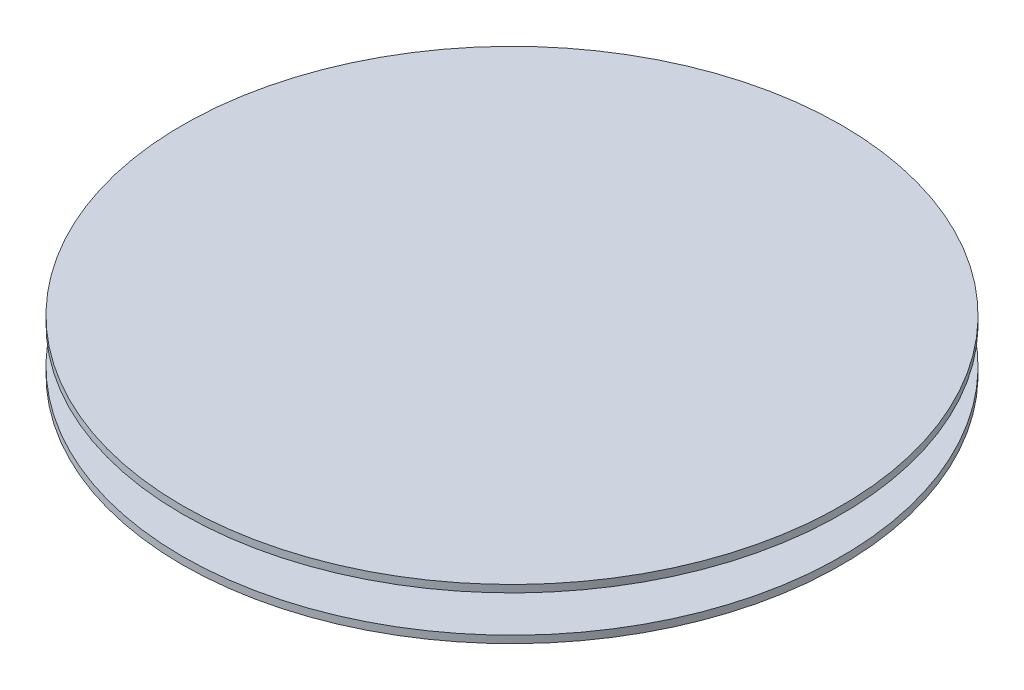
ISO-10303-21;
HEADER;
FILE_DESCRIPTION(('STEP AP214'),'2;1');
FILE_NAME('part.step','',(''),(''),'','','');
FILE_SCHEMA(('AUTOMOTIVE_DESIGN { 1 0 10303 214 1 1 1 1 }'));
ENDSEC;
DATA;
#1=APPLICATION_CONTEXT('core data for automotive mechanical design processes');
#2=APPLICATION_PROTOCOL_DEFINITION('international standard','automotive_design',2000,#1);
#3=PRODUCT_CONTEXT('',#1,'mechanical');
#4=PRODUCT('Part','Part','',(#3));
#5=PRODUCT_RELATED_PRODUCT_CATEGORY('part','',(#4));
#6=PRODUCT_DEFINITION_FORMATION('','',#4);
#7=PRODUCT_DEFINITION_CONTEXT('part definition',#1,'design');
#8=PRODUCT_DEFINITION('design','',#6,#7);
#9=PRODUCT_DEFINITION_SHAPE('','',#8);
#10=(LENGTH_UNIT() NAMED_UNIT(*) SI_UNIT(.MILLI.,.METRE.));
#11=(NAMED_UNIT(*) PLANE_ANGLE_UNIT() SI_UNIT($,.RADIAN.));
#12=(NAMED_UNIT(*) SI_UNIT($,.STERADIAN.) SOLID_ANGLE_UNIT());
#13=UNCERTAINTY_MEASURE_WITH_UNIT(LENGTH_MEASURE(1.E-05),#10,'distance_accuracy_value','');
#14=(GEOMETRIC_REPRESENTATION_CONTEXT(3) GLOBAL_UNCERTAINTY_ASSIGNED_CONTEXT((#13)) GLOBAL_UNIT_ASSIGNED_CONTEXT((#10,
#11,#12)) REPRESENTATION_CONTEXT('',''));
#15=CARTESIAN_POINT('',(0.,0.,0.));
#16=DIRECTION('',(0.,0.,1.));
#17=DIRECTION('',(1.,0.,0.));
#18=AXIS2_PLACEMENT_3D('',#15,#16,#17);
#19=CARTESIAN_POINT('',(0.,12.,0.));
#20=DIRECTION('',(0.,-1.,0.));
#21=DIRECTION('',(0.,0.,-1.));
#22=AXIS2_PLACEMENT_3D('',#19,#20,#21);
#23=CYLINDRICAL_SURFACE('',#22,75.);
#24=CARTESIAN_POINT('',(0.,12.,0.));
#25=DIRECTION('',(0.,1.,0.));
#26=DIRECTION('',(0.,0.,1.));
#27=AXIS2_PLACEMENT_3D('',#24,#25,#26);
#28=CIRCLE('',#27,75.);
#29=CARTESIAN_POINT('',(0.,12.,75.));
#30=VERTEX_POINT('',#29);
#31=EDGE_CURVE('E11',#30,#30,#28,.T.);
#32=ORIENTED_EDGE('',*,*,#31,.F.);
#33=EDGE_LOOP('',(#32));
#34=FACE_BOUND('',#33,.T.);
#35=CARTESIAN_POINT('',(0.,2.,0.));
#36=DIRECTION('',(0.,1.,0.));
#37=DIRECTION('',(0.,0.,1.));
#38=AXIS2_PLACEMENT_3D('',#35,#36,#37);
#39=CIRCLE('',#38,75.);
#40=CARTESIAN_POINT('',(0.,2.,75.));
#41=VERTEX_POINT('',#40);
#42=EDGE_CURVE('E48',#41,#41,#39,.T.);
#43=ORIENTED_EDGE('',*,*,#42,.T.);
#44=EDGE_LOOP('',(#43));
#45=FACE_BOUND('',#44,.T.);
#46=ADVANCED_FACE('F45',(#34,#45),#23,.T.);
#47=CARTESIAN_POINT('',(0.,2.,0.));
#48=DIRECTION('',(0.,1.,0.));
#49=DIRECTION('',(0.,0.,1.));
#50=AXIS2_PLACEMENT_3D('',#47,#48,#49);
#51=PLANE('',#50);
#52=CARTESIAN_POINT('',(0.,2.,0.));
#53=DIRECTION('',(0.,-1.,0.));
#54=DIRECTION('',(0.,0.,-1.));
#55=AXIS2_PLACEMENT_3D('',#52,#53,#54);
#56=CIRCLE('',#55,70.);
#57=CARTESIAN_POINT('',(0.,2.,-70.));
#58=VERTEX_POINT('',#57);
#59=EDGE_CURVE('E63',#58,#58,#56,.T.);
#60=ORIENTED_EDGE('',*,*,#59,.F.);
#61=EDGE_LOOP('',(#60));
#62=FACE_BOUND('',#61,.T.);
#63=ORIENTED_EDGE('',*,*,#42,.F.);
#64=EDGE_LOOP('',(#63));
#65=FACE_BOUND('',#64,.T.);
#66=ADVANCED_FACE('F78',(#62,#65),#51,.F.);
#67=CARTESIAN_POINT('',(0.,14.,0.));
#68=DIRECTION('',(0.,-1.,0.));
#69=DIRECTION('',(0.,0.,-1.));
#70=AXIS2_PLACEMENT_3D('',#67,#68,#69);
#71=CYLINDRICAL_SURFACE('',#70,90.);
#72=CARTESIAN_POINT('',(0.,14.,0.));
#73=DIRECTION('',(0.,1.,0.));
#74=DIRECTION('',(0.,0.,1.));
#75=AXIS2_PLACEMENT_3D('',#72,#73,#74);
#76=CIRCLE('',#75,90.);
#77=CARTESIAN_POINT('',(0.,14.,90.));
#78=VERTEX_POINT('',#77);
#79=EDGE_CURVE('E55',#78,#78,#76,.T.);
#80=ORIENTED_EDGE('',*,*,#79,.F.);
#81=EDGE_LOOP('',(#80));
#82=FACE_BOUND('',#81,.T.);
#83=CARTESIAN_POINT('',(0.,12.,0.));
#84=DIRECTION('',(0.,1.,0.));
#85=DIRECTION('',(0.,0.,1.));
#86=AXIS2_PLACEMENT_3D('',#83,#84,#85);
#87=CIRCLE('',#86,90.);
#88=CARTESIAN_POINT('',(0.,12.,90.));
#89=VERTEX_POINT('',#88);
#90=EDGE_CURVE('E57',#89,#89,#87,.T.);
#91=ORIENTED_EDGE('',*,*,#90,.T.);
#92=EDGE_LOOP('',(#91));
#93=FACE_BOUND('',#92,.T.);
#94=ADVANCED_FACE('F81',(#82,#93),#71,.T.);
#95=CARTESIAN_POINT('',(0.,14.,0.));
#96=DIRECTION('',(0.,1.,0.));
#97=DIRECTION('',(0.,0.,1.));
#98=AXIS2_PLACEMENT_3D('',#95,#96,#97);
#99=PLANE('',#98);
#100=ORIENTED_EDGE('',*,*,#79,.T.);
#101=EDGE_LOOP('',(#100));
#102=FACE_BOUND('',#101,.T.);
#103=ADVANCED_FACE('F101',(#102),#99,.T.);
#104=CARTESIAN_POINT('',(0.,12.,0.));
#105=DIRECTION('',(0.,1.,0.));
#106=DIRECTION('',(0.,0.,1.));
#107=AXIS2_PLACEMENT_3D('',#104,#105,#106);
#108=PLANE('',#107);
#109=ORIENTED_EDGE('',*,*,#31,.T.);
#110=EDGE_LOOP('',(#109));
#111=FACE_BOUND('',#110,.T.);
#112=ORIENTED_EDGE('',*,*,#90,.F.);
#113=EDGE_LOOP('',(#112));
#114=FACE_BOUND('',#113,.T.);
#115=ADVANCED_FACE('F74',(#111,#114),#108,.F.);
#116=CARTESIAN_POINT('',(0.,10.,0.));
#117=DIRECTION('',(0.,-1.,0.));
#118=DIRECTION('',(0.,0.,-1.));
#119=AXIS2_PLACEMENT_3D('',#116,#117,#118);
#120=CYLINDRICAL_SURFACE('',#119,70.);
#121=CARTESIAN_POINT('',(0.,10.,0.));
#122=DIRECTION('',(0.,-1.,0.));
#123=DIRECTION('',(0.,0.,-1.));
#124=AXIS2_PLACEMENT_3D('',#121,#122,#123);
#125=CIRCLE('',#124,70.);
#126=CARTESIAN_POINT('',(0.,10.,-70.));
#127=VERTEX_POINT('',#126);
#128=EDGE_CURVE('E60',#127,#127,#125,.T.);
#129=ORIENTED_EDGE('',*,*,#128,.F.);
#130=EDGE_LOOP('',(#129));
#131=FACE_BOUND('',#130,.T.);
#132=ORIENTED_EDGE('',*,*,#59,.T.);
#133=EDGE_LOOP('',(#132));
#134=FACE_BOUND('',#133,.T.);
#135=ADVANCED_FACE('F71',(#131,#134),#120,.F.);
#136=CARTESIAN_POINT('',(0.,10.,0.));
#137=DIRECTION('',(0.,-1.,0.));
#138=DIRECTION('',(0.,0.,-1.));
#139=AXIS2_PLACEMENT_3D('',#136,#137,#138);
#140=PLANE('',#139);
#141=ORIENTED_EDGE('',*,*,#128,.T.);
#142=EDGE_LOOP('',(#141));
#143=FACE_BOUND('',#142,.T.);
#144=ADVANCED_FACE('F69',(#143),#140,.T.);
#145=CLOSED_SHELL('',(#46,#66,#94,#103,#115,#135,#144));
#146=MANIFOLD_SOLID_BREP('B2',#145);
#147=CARTESIAN_POINT('',(0.,2.,0.));
#148=DIRECTION('',(0.,1.,0.));
#149=DIRECTION('',(0.,0.,1.));
#150=AXIS2_PLACEMENT_3D('',#147,#148,#149);
#151=PLANE('',#150);
#152=CARTESIAN_POINT('',(0.,2.,0.));
#153=DIRECTION('',(0.,1.,0.));
#154=DIRECTION('',(0.,0.,1.));
#155=AXIS2_PLACEMENT_3D('',#152,#153,#154);
#156=CIRCLE('',#155,90.);
#157=CARTESIAN_POINT('',(0.,2.,90.));
#158=VERTEX_POINT('',#157);
#159=EDGE_CURVE('E44',#158,#158,#156,.T.);
#160=ORIENTED_EDGE('',*,*,#159,.T.);
#161=EDGE_LOOP('',(#160));
#162=FACE_BOUND('',#161,.T.);
#163=CARTESIAN_POINT('',(0.,2.,0.));
#164=DIRECTION('',(0.,1.,0.));
#165=DIRECTION('',(0.,0.,1.));
#166=AXIS2_PLACEMENT_3D('',#163,#164,#165);
#167=CIRCLE('',#166,75.);
#168=CARTESIAN_POINT('',(0.,2.,75.));
#169=VERTEX_POINT('',#168);
#170=EDGE_CURVE('E189',#169,#169,#167,.T.);
#171=ORIENTED_EDGE('',*,*,#170,.F.);
#172=EDGE_LOOP('',(#171));
#173=FACE_BOUND('',#172,.T.);
#174=ADVANCED_FACE('F178',(#162,#173),#151,.T.);
#175=CARTESIAN_POINT('',(0.,0.,0.));
#176=DIRECTION('',(0.,1.,0.));
#177=DIRECTION('',(0.,0.,1.));
#178=AXIS2_PLACEMENT_3D('',#175,#176,#177);
#179=PLANE('',#178);
#180=CARTESIAN_POINT('',(0.,0.,0.));
#181=DIRECTION('',(0.,1.,0.));
#182=DIRECTION('',(0.,0.,1.));
#183=AXIS2_PLACEMENT_3D('',#180,#181,#182);
#184=CIRCLE('',#183,90.);
#185=CARTESIAN_POINT('',(0.,0.,90.));
#186=VERTEX_POINT('',#185);
#187=EDGE_CURVE('E182',#186,#186,#184,.T.);
#188=ORIENTED_EDGE('',*,*,#187,.F.);
#189=EDGE_LOOP('',(#188));
#190=FACE_BOUND('',#189,.T.);
#191=CARTESIAN_POINT('',(0.,0.,0.));
#192=DIRECTION('',(0.,1.,0.));
#193=DIRECTION('',(0.,0.,1.));
#194=AXIS2_PLACEMENT_3D('',#191,#192,#193);
#195=CIRCLE('',#194,75.);
#196=CARTESIAN_POINT('',(0.,0.,75.));
#197=VERTEX_POINT('',#196);
#198=EDGE_CURVE('E191',#197,#197,#195,.T.);
#199=ORIENTED_EDGE('',*,*,#198,.T.);
#200=EDGE_LOOP('',(#199));
#201=FACE_BOUND('',#200,.T.);
#202=ADVANCED_FACE('F201',(#190,#201),#179,.F.);
#203=CARTESIAN_POINT('',(0.,2.,0.));
#204=DIRECTION('',(0.,-1.,0.));
#205=DIRECTION('',(0.,0.,-1.));
#206=AXIS2_PLACEMENT_3D('',#203,#204,#205);
#207=CYLINDRICAL_SURFACE('',#206,90.);
#208=ORIENTED_EDGE('',*,*,#159,.F.);
#209=EDGE_LOOP('',(#208));
#210=FACE_BOUND('',#209,.T.);
#211=ORIENTED_EDGE('',*,*,#187,.T.);
#212=EDGE_LOOP('',(#211));
#213=FACE_BOUND('',#212,.T.);
#214=ADVANCED_FACE('F180',(#210,#213),#207,.T.);
#215=CARTESIAN_POINT('',(0.,2.,0.));
#216=DIRECTION('',(0.,-1.,0.));
#217=DIRECTION('',(0.,0.,-1.));
#218=AXIS2_PLACEMENT_3D('',#215,#216,#217);
#219=CYLINDRICAL_SURFACE('',#218,75.);
#220=ORIENTED_EDGE('',*,*,#170,.T.);
#221=EDGE_LOOP('',(#220));
#222=FACE_BOUND('',#221,.T.);
#223=ORIENTED_EDGE('',*,*,#198,.F.);
#224=EDGE_LOOP('',(#223));
#225=FACE_BOUND('',#224,.T.);
#226=ADVANCED_FACE('F197',(#222,#225),#219,.F.);
#227=CLOSED_SHELL('',(#174,#202,#214,#226));
#228=MANIFOLD_SOLID_BREP('B6',#227);
#229=ADVANCED_BREP_SHAPE_REPRESENTATION('',(#18,#146,#228),#14);
#230=SHAPE_DEFINITION_REPRESENTATION(#9,#229);
ENDSEC;
END-ISO-10303-21;
